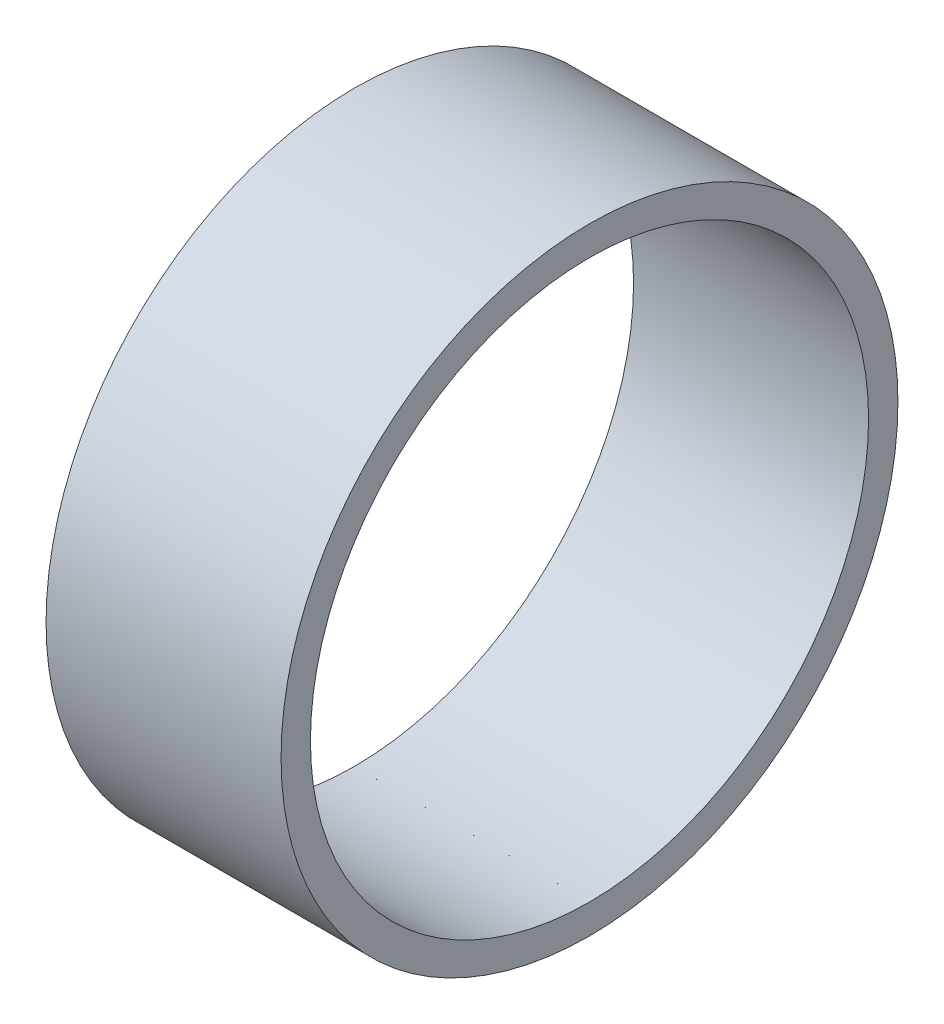
ISO-10303-21;
HEADER;
FILE_DESCRIPTION(('STEP AP214'),'2;1');
FILE_NAME('part.step','',(''),(''),'','','');
FILE_SCHEMA(('AUTOMOTIVE_DESIGN { 1 0 10303 214 1 1 1 1 }'));
ENDSEC;
DATA;
#1=APPLICATION_CONTEXT('core data for automotive mechanical design processes');
#2=APPLICATION_PROTOCOL_DEFINITION('international standard','automotive_design',2000,#1);
#3=PRODUCT_CONTEXT('',#1,'mechanical');
#4=PRODUCT('Part','Part','',(#3));
#5=PRODUCT_RELATED_PRODUCT_CATEGORY('part','',(#4));
#6=PRODUCT_DEFINITION_FORMATION('','',#4);
#7=PRODUCT_DEFINITION_CONTEXT('part definition',#1,'design');
#8=PRODUCT_DEFINITION('design','',#6,#7);
#9=PRODUCT_DEFINITION_SHAPE('','',#8);
#10=(LENGTH_UNIT() NAMED_UNIT(*) SI_UNIT(.MILLI.,.METRE.));
#11=(NAMED_UNIT(*) PLANE_ANGLE_UNIT() SI_UNIT($,.RADIAN.));
#12=(NAMED_UNIT(*) SI_UNIT($,.STERADIAN.) SOLID_ANGLE_UNIT());
#13=UNCERTAINTY_MEASURE_WITH_UNIT(LENGTH_MEASURE(1.E-05),#10,'distance_accuracy_value','');
#14=(GEOMETRIC_REPRESENTATION_CONTEXT(3) GLOBAL_UNCERTAINTY_ASSIGNED_CONTEXT((#13)) GLOBAL_UNIT_ASSIGNED_CONTEXT((#10,
#11,#12)) REPRESENTATION_CONTEXT('',''));
#15=CARTESIAN_POINT('',(0.,0.,0.));
#16=DIRECTION('',(0.,0.,1.));
#17=DIRECTION('',(1.,0.,0.));
#18=AXIS2_PLACEMENT_3D('',#15,#16,#17);
#19=CARTESIAN_POINT('',(-39.9999999999998,-209.15826535898,0.));
#20=DIRECTION('',(1.,0.,0.));
#21=DIRECTION('',(0.,0.,-1.));
#22=AXIS2_PLACEMENT_3D('',#19,#20,#21);
#23=PLANE('',#22);
#24=CARTESIAN_POINT('',(-40.,2.08166817117217E-13,0.));
#25=DIRECTION('',(1.,0.,0.));
#26=DIRECTION('',(0.,0.,-1.));
#27=AXIS2_PLACEMENT_3D('',#24,#25,#26);
#28=CIRCLE('',#27,105.);
#29=CARTESIAN_POINT('',(-40.,-105.,0.000999999998974044));
#30=VERTEX_POINT('',#29);
#31=CARTESIAN_POINT('',(-40.,-105.,-0.000999999998974044));
#32=VERTEX_POINT('',#31);
#33=EDGE_CURVE('E13',#30,#32,#28,.F.);
#34=ORIENTED_EDGE('',*,*,#33,.T.);
#35=DIRECTION('',(0.,1.,0.));
#36=VECTOR('',#35,1.);
#37=CARTESIAN_POINT('',(-40.,-105.,-0.000999999998974044));
#38=LINE('',#37,#36);
#39=CARTESIAN_POINT('',(-40.,-94.9999999973682,-0.000999999999036714));
#40=VERTEX_POINT('',#39);
#41=EDGE_CURVE('E93',#32,#40,#38,.T.);
#42=ORIENTED_EDGE('',*,*,#41,.T.);
#43=CARTESIAN_POINT('',(-40.,2.08166817117217E-13,0.));
#44=DIRECTION('',(1.,0.,0.));
#45=DIRECTION('',(0.,0.,-1.));
#46=AXIS2_PLACEMENT_3D('',#43,#44,#45);
#47=CIRCLE('',#46,94.9999999999998);
#48=CARTESIAN_POINT('',(-40.,-94.9999999973682,0.000999999999036714));
#49=VERTEX_POINT('',#48);
#50=EDGE_CURVE('E142',#49,#40,#47,.F.);
#51=ORIENTED_EDGE('',*,*,#50,.F.);
#52=DIRECTION('',(0.,1.,0.));
#53=VECTOR('',#52,1.);
#54=CARTESIAN_POINT('',(-40.,-105.,0.000999999998974044));
#55=LINE('',#54,#53);
#56=EDGE_CURVE('E149',#30,#49,#55,.T.);
#57=ORIENTED_EDGE('',*,*,#56,.F.);
#58=EDGE_LOOP('',(#34,#42,#51,#57));
#59=FACE_BOUND('',#58,.T.);
#60=ADVANCED_FACE('F83',(#59),#23,.F.);
#61=CARTESIAN_POINT('',(-40.0000000008731,2.08166817117217E-13,0.));
#62=DIRECTION('',(1.,0.,0.));
#63=DIRECTION('',(0.,0.,1.));
#64=AXIS2_PLACEMENT_3D('',#61,#62,#63);
#65=CYLINDRICAL_SURFACE('',#64,94.9999999999998);
#66=ORIENTED_EDGE('',*,*,#50,.T.);
#67=DIRECTION('',(1.,0.,0.));
#68=VECTOR('',#67,1.);
#69=CARTESIAN_POINT('',(-40.,-95.,-0.000999999999029555));
#70=LINE('',#69,#68);
#71=CARTESIAN_POINT('',(40.,-94.9999999973682,-0.000999999999036714));
#72=VERTEX_POINT('',#71);
#73=EDGE_CURVE('E140',#40,#72,#70,.T.);
#74=ORIENTED_EDGE('',*,*,#73,.T.);
#75=CARTESIAN_POINT('',(40.,2.08166817117217E-13,0.));
#76=DIRECTION('',(1.,0.,0.));
#77=DIRECTION('',(0.,0.,-1.));
#78=AXIS2_PLACEMENT_3D('',#75,#76,#77);
#79=CIRCLE('',#78,94.9999999999998);
#80=CARTESIAN_POINT('',(40.,-94.9999999973682,0.000999999999036714));
#81=VERTEX_POINT('',#80);
#82=EDGE_CURVE('E135',#81,#72,#79,.F.);
#83=ORIENTED_EDGE('',*,*,#82,.F.);
#84=DIRECTION('',(1.,0.,0.));
#85=VECTOR('',#84,1.);
#86=CARTESIAN_POINT('',(-40.,-95.,0.000999999999029555));
#87=LINE('',#86,#85);
#88=EDGE_CURVE('E127',#49,#81,#87,.T.);
#89=ORIENTED_EDGE('',*,*,#88,.F.);
#90=EDGE_LOOP('',(#66,#74,#83,#89));
#91=FACE_BOUND('',#90,.T.);
#92=ADVANCED_FACE('F157',(#91),#65,.F.);
#93=CARTESIAN_POINT('',(40.0000000000002,-209.15826535898,0.));
#94=DIRECTION('',(1.,0.,0.));
#95=DIRECTION('',(0.,0.,-1.));
#96=AXIS2_PLACEMENT_3D('',#93,#94,#95);
#97=PLANE('',#96);
#98=ORIENTED_EDGE('',*,*,#82,.T.);
#99=DIRECTION('',(0.,1.,0.));
#100=VECTOR('',#99,1.);
#101=CARTESIAN_POINT('',(40.,-105.,-0.000999999998974044));
#102=LINE('',#101,#100);
#103=CARTESIAN_POINT('',(40.,-105.,-0.000999999998974044));
#104=VERTEX_POINT('',#103);
#105=EDGE_CURVE('E124',#104,#72,#102,.T.);
#106=ORIENTED_EDGE('',*,*,#105,.F.);
#107=CARTESIAN_POINT('',(40.,2.08166817117217E-13,0.));
#108=DIRECTION('',(1.,0.,0.));
#109=DIRECTION('',(0.,0.,-1.));
#110=AXIS2_PLACEMENT_3D('',#107,#108,#109);
#111=CIRCLE('',#110,105.);
#112=CARTESIAN_POINT('',(40.,-105.,0.000999999998974044));
#113=VERTEX_POINT('',#112);
#114=EDGE_CURVE('E87',#113,#104,#111,.F.);
#115=ORIENTED_EDGE('',*,*,#114,.F.);
#116=DIRECTION('',(0.,1.,0.));
#117=VECTOR('',#116,1.);
#118=CARTESIAN_POINT('',(40.,-105.,0.000999999998974044));
#119=LINE('',#118,#117);
#120=EDGE_CURVE('E132',#113,#81,#119,.T.);
#121=ORIENTED_EDGE('',*,*,#120,.T.);
#122=EDGE_LOOP('',(#98,#106,#115,#121));
#123=FACE_BOUND('',#122,.T.);
#124=ADVANCED_FACE('F133',(#123),#97,.T.);
#125=CARTESIAN_POINT('',(-40.0000000008731,2.08166817117217E-13,0.));
#126=DIRECTION('',(1.,0.,0.));
#127=DIRECTION('',(0.,0.,1.));
#128=AXIS2_PLACEMENT_3D('',#125,#126,#127);
#129=CYLINDRICAL_SURFACE('',#128,105.);
#130=ORIENTED_EDGE('',*,*,#114,.T.);
#131=DIRECTION('',(1.,0.,0.));
#132=VECTOR('',#131,1.);
#133=CARTESIAN_POINT('',(-40.,-105.,-0.000999999998974044));
#134=LINE('',#133,#132);
#135=EDGE_CURVE('E102',#32,#104,#134,.T.);
#136=ORIENTED_EDGE('',*,*,#135,.F.);
#137=ORIENTED_EDGE('',*,*,#33,.F.);
#138=DIRECTION('',(1.,0.,0.));
#139=VECTOR('',#138,1.);
#140=CARTESIAN_POINT('',(-40.,-105.,0.000999999998974044));
#141=LINE('',#140,#139);
#142=EDGE_CURVE('E119',#30,#113,#141,.T.);
#143=ORIENTED_EDGE('',*,*,#142,.T.);
#144=EDGE_LOOP('',(#130,#136,#137,#143));
#145=FACE_BOUND('',#144,.T.);
#146=ADVANCED_FACE('F129',(#145),#129,.T.);
#147=CARTESIAN_POINT('',(0.,0.,0.000999999999695689));
#148=DIRECTION('',(0.,0.,-1.));
#149=DIRECTION('',(1.,0.,0.));
#150=AXIS2_PLACEMENT_3D('',#147,#148,#149);
#151=PLANE('',#150);
#152=ORIENTED_EDGE('',*,*,#56,.T.);
#153=ORIENTED_EDGE('',*,*,#88,.T.);
#154=ORIENTED_EDGE('',*,*,#120,.F.);
#155=ORIENTED_EDGE('',*,*,#142,.F.);
#156=EDGE_LOOP('',(#152,#153,#154,#155));
#157=FACE_BOUND('',#156,.T.);
#158=ADVANCED_FACE('F153',(#157),#151,.T.);
#159=CARTESIAN_POINT('',(0.,0.,-0.000999999999695689));
#160=DIRECTION('',(0.,0.,-1.));
#161=DIRECTION('',(1.,0.,0.));
#162=AXIS2_PLACEMENT_3D('',#159,#160,#161);
#163=PLANE('',#162);
#164=ORIENTED_EDGE('',*,*,#41,.F.);
#165=ORIENTED_EDGE('',*,*,#135,.T.);
#166=ORIENTED_EDGE('',*,*,#105,.T.);
#167=ORIENTED_EDGE('',*,*,#73,.F.);
#168=EDGE_LOOP('',(#164,#165,#166,#167));
#169=FACE_BOUND('',#168,.T.);
#170=ADVANCED_FACE('F85',(#169),#163,.F.);
#171=CLOSED_SHELL('',(#60,#92,#124,#146,#158,#170));
#172=MANIFOLD_SOLID_BREP('B2',#171);
#173=ADVANCED_BREP_SHAPE_REPRESENTATION('',(#18,#172),#14);
#174=SHAPE_DEFINITION_REPRESENTATION(#9,#173);
ENDSEC;
END-ISO-10303-21;
